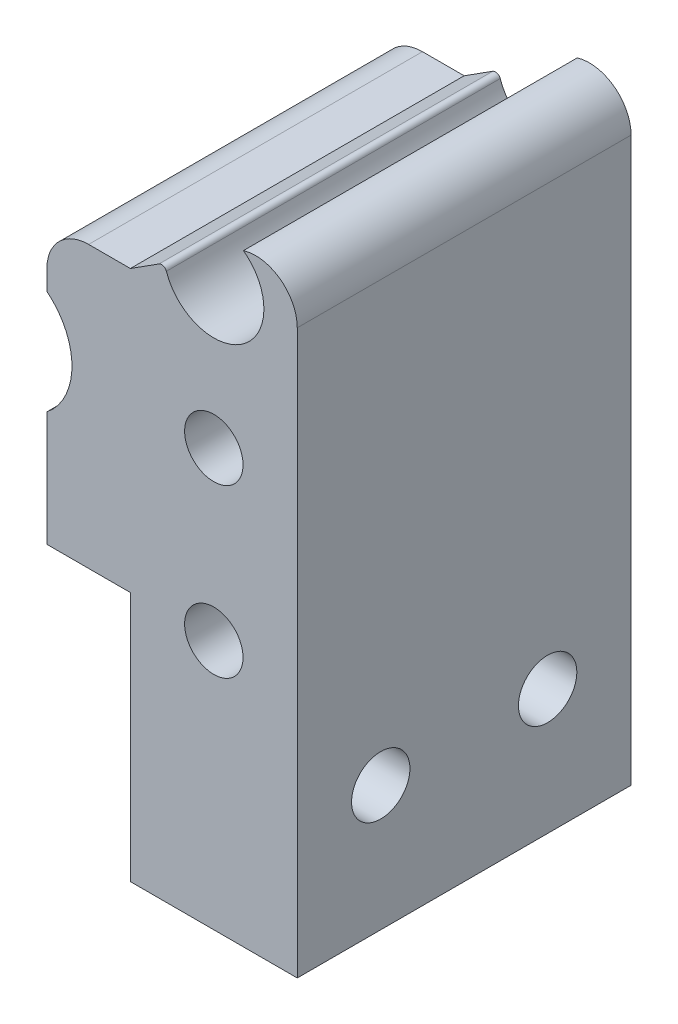
ISO-10303-21;
HEADER;
FILE_DESCRIPTION(('STEP AP214'),'2;1');
FILE_NAME('part.step','',(''),(''),'','','');
FILE_SCHEMA(('AUTOMOTIVE_DESIGN { 1 0 10303 214 1 1 1 1 }'));
ENDSEC;
DATA;
#1=APPLICATION_CONTEXT('core data for automotive mechanical design processes');
#2=APPLICATION_PROTOCOL_DEFINITION('international standard','automotive_design',2000,#1);
#3=PRODUCT_CONTEXT('',#1,'mechanical');
#4=PRODUCT('Part','Part','',(#3));
#5=PRODUCT_RELATED_PRODUCT_CATEGORY('part','',(#4));
#6=PRODUCT_DEFINITION_FORMATION('','',#4);
#7=PRODUCT_DEFINITION_CONTEXT('part definition',#1,'design');
#8=PRODUCT_DEFINITION('design','',#6,#7);
#9=PRODUCT_DEFINITION_SHAPE('','',#8);
#10=(LENGTH_UNIT() NAMED_UNIT(*) SI_UNIT(.MILLI.,.METRE.));
#11=(NAMED_UNIT(*) PLANE_ANGLE_UNIT() SI_UNIT($,.RADIAN.));
#12=(NAMED_UNIT(*) SI_UNIT($,.STERADIAN.) SOLID_ANGLE_UNIT());
#13=UNCERTAINTY_MEASURE_WITH_UNIT(LENGTH_MEASURE(1.E-05),#10,'distance_accuracy_value','');
#14=(GEOMETRIC_REPRESENTATION_CONTEXT(3) GLOBAL_UNCERTAINTY_ASSIGNED_CONTEXT((#13)) GLOBAL_UNIT_ASSIGNED_CONTEXT((#10,
#11,#12)) REPRESENTATION_CONTEXT('',''));
#15=CARTESIAN_POINT('',(0.,0.,0.));
#16=DIRECTION('',(0.,0.,1.));
#17=DIRECTION('',(1.,0.,0.));
#18=AXIS2_PLACEMENT_3D('',#15,#16,#17);
#19=CARTESIAN_POINT('',(-4.99999999999999,0.,20.));
#20=DIRECTION('',(1.,0.,0.));
#21=DIRECTION('',(0.,1.,0.));
#22=AXIS2_PLACEMENT_3D('',#19,#20,#21);
#23=PLANE('',#22);
#24=DIRECTION('',(0.,-1.,0.));
#25=VECTOR('',#24,1.);
#26=CARTESIAN_POINT('',(-4.99999999999999,0.,20.));
#27=LINE('',#26,#25);
#28=CARTESIAN_POINT('',(-5.,29.3146486959626,20.));
#29=VERTEX_POINT('',#28);
#30=CARTESIAN_POINT('',(-5.,28.1224989991992,20.));
#31=VERTEX_POINT('',#30);
#32=EDGE_CURVE('E265',#29,#31,#27,.T.);
#33=ORIENTED_EDGE('',*,*,#32,.F.);
#34=DIRECTION('',(0.,0.,-1.));
#35=VECTOR('',#34,1.);
#36=CARTESIAN_POINT('',(-5.,29.3146486959626,20.));
#37=LINE('',#36,#35);
#38=CARTESIAN_POINT('',(-5.,29.3146486959626,0.));
#39=VERTEX_POINT('',#38);
#40=EDGE_CURVE('E236',#29,#39,#37,.T.);
#41=ORIENTED_EDGE('',*,*,#40,.T.);
#42=DIRECTION('',(0.,-1.,0.));
#43=VECTOR('',#42,1.);
#44=CARTESIAN_POINT('',(-4.99999999999999,0.,0.));
#45=LINE('',#44,#43);
#46=CARTESIAN_POINT('',(-5.,28.1224989991992,0.));
#47=VERTEX_POINT('',#46);
#48=EDGE_CURVE('E176',#39,#47,#45,.T.);
#49=ORIENTED_EDGE('',*,*,#48,.T.);
#50=DIRECTION('',(0.,0.,1.));
#51=VECTOR('',#50,1.);
#52=CARTESIAN_POINT('',(-5.,28.1224989991992,0.));
#53=LINE('',#52,#51);
#54=EDGE_CURVE('E152',#47,#31,#53,.T.);
#55=ORIENTED_EDGE('',*,*,#54,.T.);
#56=EDGE_LOOP('',(#33,#41,#49,#55));
#57=FACE_BOUND('',#56,.T.);
#58=ADVANCED_FACE('F49',(#57),#23,.F.);
#59=CARTESIAN_POINT('',(-14.4169319274931,22.6300501128707,20.));
#60=DIRECTION('',(-0.537299608346822,0.843391445812887,0.));
#61=DIRECTION('',(-0.843391445812887,-0.537299608346822,0.));
#62=AXIS2_PLACEMENT_3D('',#59,#60,#61);
#63=PLANE('',#62);
#64=DIRECTION('',(0.843391445812887,0.537299608346822,0.));
#65=VECTOR('',#64,1.);
#66=CARTESIAN_POINT('',(-14.4169319274931,22.6300501128707,20.));
#67=LINE('',#66,#65);
#68=CARTESIAN_POINT('',(0.,31.8146486959626,20.));
#69=VERTEX_POINT('',#68);
#70=CARTESIAN_POINT('',(1.71274737401555,32.905789112224,20.));
#71=VERTEX_POINT('',#70);
#72=EDGE_CURVE('E206',#69,#71,#67,.T.);
#73=ORIENTED_EDGE('',*,*,#72,.T.);
#74=DIRECTION('',(0.,0.,-1.));
#75=VECTOR('',#74,1.);
#76=CARTESIAN_POINT('',(1.71274737401554,32.905789112224,0.));
#77=LINE('',#76,#75);
#78=CARTESIAN_POINT('',(1.71274737401555,32.905789112224,0.));
#79=VERTEX_POINT('',#78);
#80=EDGE_CURVE('E58',#71,#79,#77,.T.);
#81=ORIENTED_EDGE('',*,*,#80,.T.);
#82=DIRECTION('',(0.843391445812887,0.537299608346822,0.));
#83=VECTOR('',#82,1.);
#84=CARTESIAN_POINT('',(-14.4169319274931,22.6300501128707,0.));
#85=LINE('',#84,#83);
#86=CARTESIAN_POINT('',(0.,31.8146486959626,0.));
#87=VERTEX_POINT('',#86);
#88=EDGE_CURVE('E198',#87,#79,#85,.T.);
#89=ORIENTED_EDGE('',*,*,#88,.F.);
#90=DIRECTION('',(0.,0.,-1.));
#91=VECTOR('',#90,1.);
#92=CARTESIAN_POINT('',(0.,31.8146486959626,20.));
#93=LINE('',#92,#91);
#94=EDGE_CURVE('E202',#69,#87,#93,.T.);
#95=ORIENTED_EDGE('',*,*,#94,.F.);
#96=EDGE_LOOP('',(#73,#81,#89,#95));
#97=FACE_BOUND('',#96,.T.);
#98=ADVANCED_FACE('F362',(#97),#63,.T.);
#99=CARTESIAN_POINT('',(0.,31.8146486959626,20.));
#100=DIRECTION('',(0.,-1.,0.));
#101=DIRECTION('',(0.,0.,-1.));
#102=AXIS2_PLACEMENT_3D('',#99,#100,#101);
#103=PLANE('',#102);
#104=DIRECTION('',(-1.,0.,0.));
#105=VECTOR('',#104,1.);
#106=CARTESIAN_POINT('',(0.,31.8146486959626,0.));
#107=LINE('',#106,#105);
#108=CARTESIAN_POINT('',(-2.5,31.8146486959626,0.));
#109=VERTEX_POINT('',#108);
#110=EDGE_CURVE('E177',#87,#109,#107,.T.);
#111=ORIENTED_EDGE('',*,*,#110,.T.);
#112=DIRECTION('',(0.,0.,-1.));
#113=VECTOR('',#112,1.);
#114=CARTESIAN_POINT('',(-2.5,31.8146486959626,20.));
#115=LINE('',#114,#113);
#116=CARTESIAN_POINT('',(-2.5,31.8146486959626,20.));
#117=VERTEX_POINT('',#116);
#118=EDGE_CURVE('E240',#109,#117,#115,.F.);
#119=ORIENTED_EDGE('',*,*,#118,.T.);
#120=DIRECTION('',(-1.,0.,0.));
#121=VECTOR('',#120,1.);
#122=CARTESIAN_POINT('',(0.,31.8146486959626,20.));
#123=LINE('',#122,#121);
#124=EDGE_CURVE('E201',#69,#117,#123,.T.);
#125=ORIENTED_EDGE('',*,*,#124,.F.);
#126=ORIENTED_EDGE('',*,*,#94,.T.);
#127=EDGE_LOOP('',(#111,#119,#125,#126));
#128=FACE_BOUND('',#127,.T.);
#129=ADVANCED_FACE('F351',(#128),#103,.F.);
#130=CARTESIAN_POINT('',(-5.,21.8775010008008,20.));
#131=VERTEX_POINT('',#130);
#132=CARTESIAN_POINT('',(-5.,15.,20.));
#133=VERTEX_POINT('',#132);
#134=EDGE_CURVE('E166',#131,#133,#27,.T.);
#135=ORIENTED_EDGE('',*,*,#134,.F.);
#136=DIRECTION('',(0.,0.,1.));
#137=VECTOR('',#136,1.);
#138=CARTESIAN_POINT('',(-5.,21.8775010008008,0.));
#139=LINE('',#138,#137);
#140=CARTESIAN_POINT('',(-5.,21.8775010008008,0.));
#141=VERTEX_POINT('',#140);
#142=EDGE_CURVE('E149',#131,#141,#139,.F.);
#143=ORIENTED_EDGE('',*,*,#142,.T.);
#144=CARTESIAN_POINT('',(-5.,15.,0.));
#145=VERTEX_POINT('',#144);
#146=EDGE_CURVE('E164',#141,#145,#45,.T.);
#147=ORIENTED_EDGE('',*,*,#146,.T.);
#148=DIRECTION('',(0.,0.,-1.));
#149=VECTOR('',#148,1.);
#150=CARTESIAN_POINT('',(-5.,15.,20.));
#151=LINE('',#150,#149);
#152=EDGE_CURVE('E158',#133,#145,#151,.T.);
#153=ORIENTED_EDGE('',*,*,#152,.F.);
#154=EDGE_LOOP('',(#135,#143,#147,#153));
#155=FACE_BOUND('',#154,.T.);
#156=ADVANCED_FACE('F162',(#155),#23,.F.);
#157=CARTESIAN_POINT('',(0.,15.,20.));
#158=DIRECTION('',(0.,-1.,0.));
#159=DIRECTION('',(1.,0.,0.));
#160=AXIS2_PLACEMENT_3D('',#157,#158,#159);
#161=PLANE('',#160);
#162=DIRECTION('',(-1.,0.,0.));
#163=VECTOR('',#162,1.);
#164=CARTESIAN_POINT('',(0.,15.,0.));
#165=LINE('',#164,#163);
#166=CARTESIAN_POINT('',(0.,15.,0.));
#167=VERTEX_POINT('',#166);
#168=EDGE_CURVE('E174',#167,#145,#165,.T.);
#169=ORIENTED_EDGE('',*,*,#168,.F.);
#170=DIRECTION('',(0.,0.,-1.));
#171=VECTOR('',#170,1.);
#172=CARTESIAN_POINT('',(0.,15.,20.));
#173=LINE('',#172,#171);
#174=CARTESIAN_POINT('',(0.,15.,20.));
#175=VERTEX_POINT('',#174);
#176=EDGE_CURVE('E213',#175,#167,#173,.T.);
#177=ORIENTED_EDGE('',*,*,#176,.F.);
#178=DIRECTION('',(-1.,0.,0.));
#179=VECTOR('',#178,1.);
#180=CARTESIAN_POINT('',(0.,15.,20.));
#181=LINE('',#180,#179);
#182=EDGE_CURVE('E261',#175,#133,#181,.T.);
#183=ORIENTED_EDGE('',*,*,#182,.T.);
#184=ORIENTED_EDGE('',*,*,#152,.T.);
#185=EDGE_LOOP('',(#169,#177,#183,#184));
#186=FACE_BOUND('',#185,.T.);
#187=ADVANCED_FACE('F343',(#186),#161,.T.);
#188=CARTESIAN_POINT('',(0.,0.,20.));
#189=DIRECTION('',(-1.,0.,0.));
#190=DIRECTION('',(0.,-1.,0.));
#191=AXIS2_PLACEMENT_3D('',#188,#189,#190);
#192=PLANE('',#191);
#193=CARTESIAN_POINT('',(0.,7.5,15.));
#194=DIRECTION('',(-1.,0.,0.));
#195=DIRECTION('',(0.,-1.,0.));
#196=AXIS2_PLACEMENT_3D('',#193,#194,#195);
#197=CIRCLE('',#196,1.75);
#198=CARTESIAN_POINT('',(0.,5.75,15.));
#199=VERTEX_POINT('',#198);
#200=EDGE_CURVE('E182',#199,#199,#197,.T.);
#201=ORIENTED_EDGE('',*,*,#200,.F.);
#202=EDGE_LOOP('',(#201));
#203=FACE_BOUND('',#202,.T.);
#204=CARTESIAN_POINT('',(0.,7.5,5.));
#205=DIRECTION('',(-1.,0.,0.));
#206=DIRECTION('',(0.,-1.,0.));
#207=AXIS2_PLACEMENT_3D('',#204,#205,#206);
#208=CIRCLE('',#207,1.75);
#209=CARTESIAN_POINT('',(0.,5.75,5.));
#210=VERTEX_POINT('',#209);
#211=EDGE_CURVE('E278',#210,#210,#208,.T.);
#212=ORIENTED_EDGE('',*,*,#211,.F.);
#213=EDGE_LOOP('',(#212));
#214=FACE_BOUND('',#213,.T.);
#215=DIRECTION('',(0.,1.,0.));
#216=VECTOR('',#215,1.);
#217=CARTESIAN_POINT('',(0.,0.,0.));
#218=LINE('',#217,#216);
#219=CARTESIAN_POINT('',(0.,0.,0.));
#220=VERTEX_POINT('',#219);
#221=EDGE_CURVE('E188',#220,#167,#218,.T.);
#222=ORIENTED_EDGE('',*,*,#221,.F.);
#223=DIRECTION('',(0.,0.,-1.));
#224=VECTOR('',#223,1.);
#225=CARTESIAN_POINT('',(0.,0.,20.));
#226=LINE('',#225,#224);
#227=CARTESIAN_POINT('',(0.,0.,20.));
#228=VERTEX_POINT('',#227);
#229=EDGE_CURVE('E210',#228,#220,#226,.T.);
#230=ORIENTED_EDGE('',*,*,#229,.F.);
#231=DIRECTION('',(0.,1.,0.));
#232=VECTOR('',#231,1.);
#233=CARTESIAN_POINT('',(0.,0.,20.));
#234=LINE('',#233,#232);
#235=EDGE_CURVE('E257',#228,#175,#234,.T.);
#236=ORIENTED_EDGE('',*,*,#235,.T.);
#237=ORIENTED_EDGE('',*,*,#176,.T.);
#238=EDGE_LOOP('',(#222,#230,#236,#237));
#239=FACE_BOUND('',#238,.T.);
#240=ADVANCED_FACE('F339',(#203,#214,#239),#192,.T.);
#241=CARTESIAN_POINT('',(0.,0.,20.));
#242=DIRECTION('',(0.,-1.,0.));
#243=DIRECTION('',(1.,0.,0.));
#244=AXIS2_PLACEMENT_3D('',#241,#242,#243);
#245=PLANE('',#244);
#246=DIRECTION('',(-1.,0.,0.));
#247=VECTOR('',#246,1.);
#248=CARTESIAN_POINT('',(0.,0.,0.));
#249=LINE('',#248,#247);
#250=CARTESIAN_POINT('',(10.,0.,0.));
#251=VERTEX_POINT('',#250);
#252=EDGE_CURVE('E191',#251,#220,#249,.T.);
#253=ORIENTED_EDGE('',*,*,#252,.F.);
#254=DIRECTION('',(0.,0.,-1.));
#255=VECTOR('',#254,1.);
#256=CARTESIAN_POINT('',(10.,0.,20.));
#257=LINE('',#256,#255);
#258=CARTESIAN_POINT('',(10.,0.,20.));
#259=VERTEX_POINT('',#258);
#260=EDGE_CURVE('E205',#259,#251,#257,.T.);
#261=ORIENTED_EDGE('',*,*,#260,.F.);
#262=DIRECTION('',(-1.,0.,0.));
#263=VECTOR('',#262,1.);
#264=CARTESIAN_POINT('',(0.,0.,20.));
#265=LINE('',#264,#263);
#266=EDGE_CURVE('E253',#259,#228,#265,.T.);
#267=ORIENTED_EDGE('',*,*,#266,.T.);
#268=ORIENTED_EDGE('',*,*,#229,.T.);
#269=EDGE_LOOP('',(#253,#261,#267,#268));
#270=FACE_BOUND('',#269,.T.);
#271=ADVANCED_FACE('F336',(#270),#245,.T.);
#272=CARTESIAN_POINT('',(10.,0.,20.));
#273=DIRECTION('',(1.,0.,0.));
#274=DIRECTION('',(0.,1.,0.));
#275=AXIS2_PLACEMENT_3D('',#272,#273,#274);
#276=PLANE('',#275);
#277=CARTESIAN_POINT('',(10.,7.5,15.));
#278=DIRECTION('',(1.,0.,0.));
#279=DIRECTION('',(0.,0.,-1.));
#280=AXIS2_PLACEMENT_3D('',#277,#278,#279);
#281=CIRCLE('',#280,1.75);
#282=CARTESIAN_POINT('',(10.,7.5,13.25));
#283=VERTEX_POINT('',#282);
#284=EDGE_CURVE('E282',#283,#283,#281,.T.);
#285=ORIENTED_EDGE('',*,*,#284,.F.);
#286=EDGE_LOOP('',(#285));
#287=FACE_BOUND('',#286,.T.);
#288=CARTESIAN_POINT('',(10.,7.5,5.));
#289=DIRECTION('',(1.,0.,0.));
#290=DIRECTION('',(0.,0.,-1.));
#291=AXIS2_PLACEMENT_3D('',#288,#289,#290);
#292=CIRCLE('',#291,1.75);
#293=CARTESIAN_POINT('',(10.,7.5,3.25));
#294=VERTEX_POINT('',#293);
#295=EDGE_CURVE('E283',#294,#294,#292,.T.);
#296=ORIENTED_EDGE('',*,*,#295,.F.);
#297=EDGE_LOOP('',(#296));
#298=FACE_BOUND('',#297,.T.);
#299=DIRECTION('',(0.,-1.,0.));
#300=VECTOR('',#299,1.);
#301=CARTESIAN_POINT('',(10.,0.,0.));
#302=LINE('',#301,#300);
#303=CARTESIAN_POINT('',(9.99999999999999,33.7376848909864,0.));
#304=VERTEX_POINT('',#303);
#305=EDGE_CURVE('E195',#304,#251,#302,.T.);
#306=ORIENTED_EDGE('',*,*,#305,.F.);
#307=DIRECTION('',(0.,0.,-1.));
#308=VECTOR('',#307,1.);
#309=CARTESIAN_POINT('',(9.99999999999999,33.7376848909864,20.));
#310=LINE('',#309,#308);
#311=CARTESIAN_POINT('',(9.99999999999999,33.7376848909864,20.));
#312=VERTEX_POINT('',#311);
#313=EDGE_CURVE('E226',#304,#312,#310,.F.);
#314=ORIENTED_EDGE('',*,*,#313,.T.);
#315=DIRECTION('',(0.,-1.,0.));
#316=VECTOR('',#315,1.);
#317=CARTESIAN_POINT('',(10.,0.,20.));
#318=LINE('',#317,#316);
#319=EDGE_CURVE('E251',#312,#259,#318,.T.);
#320=ORIENTED_EDGE('',*,*,#319,.T.);
#321=ORIENTED_EDGE('',*,*,#260,.T.);
#322=EDGE_LOOP('',(#306,#314,#320,#321));
#323=FACE_BOUND('',#322,.T.);
#324=ADVANCED_FACE('F332',(#287,#298,#323),#276,.T.);
#325=CARTESIAN_POINT('',(0.,0.,20.));
#326=DIRECTION('',(0.,0.,1.));
#327=DIRECTION('',(1.,0.,0.));
#328=AXIS2_PLACEMENT_3D('',#325,#326,#327);
#329=PLANE('',#328);
#330=CARTESIAN_POINT('',(5.,33.71,20.));
#331=DIRECTION('',(0.,0.,1.));
#332=DIRECTION('',(1.,0.,0.));
#333=AXIS2_PLACEMENT_3D('',#330,#331,#332);
#334=CIRCLE('',#333,3.);
#335=CARTESIAN_POINT('',(2.15812477865418,32.7488833440728,20.));
#336=VERTEX_POINT('',#335);
#337=CARTESIAN_POINT('',(6.77335705099843,36.1297530389844,20.));
#338=VERTEX_POINT('',#337);
#339=EDGE_CURVE('E168',#336,#338,#334,.T.);
#340=ORIENTED_EDGE('',*,*,#339,.F.);
#341=CARTESIAN_POINT('',(1.87393725651959,32.6527716784801,20.));
#342=DIRECTION('',(0.,0.,1.));
#343=DIRECTION('',(1.,0.,0.));
#344=AXIS2_PLACEMENT_3D('',#341,#342,#343);
#345=CIRCLE('',#344,0.3);
#346=EDGE_CURVE('E72',#336,#71,#345,.T.);
#347=ORIENTED_EDGE('',*,*,#346,.T.);
#348=ORIENTED_EDGE('',*,*,#72,.F.);
#349=ORIENTED_EDGE('',*,*,#124,.T.);
#350=CARTESIAN_POINT('',(-2.5,29.3146486959626,20.));
#351=DIRECTION('',(0.,0.,1.));
#352=DIRECTION('',(1.,0.,0.));
#353=AXIS2_PLACEMENT_3D('',#350,#351,#352);
#354=CIRCLE('',#353,2.5);
#355=EDGE_CURVE('E229',#117,#29,#354,.T.);
#356=ORIENTED_EDGE('',*,*,#355,.T.);
#357=ORIENTED_EDGE('',*,*,#32,.T.);
#358=CARTESIAN_POINT('',(-7.5,25.,20.));
#359=DIRECTION('',(0.,0.,1.));
#360=DIRECTION('',(1.,0.,0.));
#361=AXIS2_PLACEMENT_3D('',#358,#359,#360);
#362=CIRCLE('',#361,4.);
#363=EDGE_CURVE('E304',#131,#31,#362,.T.);
#364=ORIENTED_EDGE('',*,*,#363,.F.);
#365=ORIENTED_EDGE('',*,*,#134,.T.);
#366=ORIENTED_EDGE('',*,*,#182,.F.);
#367=ORIENTED_EDGE('',*,*,#235,.F.);
#368=ORIENTED_EDGE('',*,*,#266,.F.);
#369=ORIENTED_EDGE('',*,*,#319,.F.);
#370=CARTESIAN_POINT('',(7.49999999999999,33.7376848909864,20.));
#371=DIRECTION('',(0.,0.,1.));
#372=DIRECTION('',(1.,0.,0.));
#373=AXIS2_PLACEMENT_3D('',#370,#371,#372);
#374=CIRCLE('',#373,2.5);
#375=EDGE_CURVE('E232',#312,#338,#374,.T.);
#376=ORIENTED_EDGE('',*,*,#375,.T.);
#377=EDGE_LOOP('',(#340,#347,#348,#349,#356,#357,#364,#365,#366,#367,#368,#369,#376));
#378=FACE_BOUND('',#377,.T.);
#379=CARTESIAN_POINT('',(5.,25.,20.));
#380=DIRECTION('',(0.,0.,1.));
#381=DIRECTION('',(1.,0.,0.));
#382=AXIS2_PLACEMENT_3D('',#379,#380,#381);
#383=CIRCLE('',#382,1.75);
#384=CARTESIAN_POINT('',(6.75,25.,20.));
#385=VERTEX_POINT('',#384);
#386=EDGE_CURVE('E307',#385,#385,#383,.T.);
#387=ORIENTED_EDGE('',*,*,#386,.F.);
#388=EDGE_LOOP('',(#387));
#389=FACE_BOUND('',#388,.T.);
#390=CARTESIAN_POINT('',(5.,15.,20.));
#391=DIRECTION('',(0.,0.,1.));
#392=DIRECTION('',(1.,0.,0.));
#393=AXIS2_PLACEMENT_3D('',#390,#391,#392);
#394=CIRCLE('',#393,1.75);
#395=CARTESIAN_POINT('',(6.75,15.,20.));
#396=VERTEX_POINT('',#395);
#397=EDGE_CURVE('E296',#396,#396,#394,.T.);
#398=ORIENTED_EDGE('',*,*,#397,.F.);
#399=EDGE_LOOP('',(#398));
#400=FACE_BOUND('',#399,.T.);
#401=ADVANCED_FACE('F323',(#378,#389,#400),#329,.T.);
#402=CARTESIAN_POINT('',(0.,0.,0.));
#403=DIRECTION('',(0.,0.,1.));
#404=DIRECTION('',(1.,0.,0.));
#405=AXIS2_PLACEMENT_3D('',#402,#403,#404);
#406=PLANE('',#405);
#407=CARTESIAN_POINT('',(5.,25.,0.));
#408=DIRECTION('',(0.,0.,1.));
#409=DIRECTION('',(1.,0.,0.));
#410=AXIS2_PLACEMENT_3D('',#407,#408,#409);
#411=CIRCLE('',#410,1.75);
#412=CARTESIAN_POINT('',(6.75,25.,0.));
#413=VERTEX_POINT('',#412);
#414=EDGE_CURVE('E311',#413,#413,#411,.T.);
#415=ORIENTED_EDGE('',*,*,#414,.T.);
#416=EDGE_LOOP('',(#415));
#417=FACE_BOUND('',#416,.T.);
#418=CARTESIAN_POINT('',(5.,15.,0.));
#419=DIRECTION('',(0.,0.,1.));
#420=DIRECTION('',(1.,0.,0.));
#421=AXIS2_PLACEMENT_3D('',#418,#419,#420);
#422=CIRCLE('',#421,1.75);
#423=CARTESIAN_POINT('',(6.75,15.,0.));
#424=VERTEX_POINT('',#423);
#425=EDGE_CURVE('E300',#424,#424,#422,.T.);
#426=ORIENTED_EDGE('',*,*,#425,.T.);
#427=EDGE_LOOP('',(#426));
#428=FACE_BOUND('',#427,.T.);
#429=ORIENTED_EDGE('',*,*,#88,.T.);
#430=CARTESIAN_POINT('',(1.87393725651959,32.6527716784801,0.));
#431=DIRECTION('',(0.,0.,1.));
#432=DIRECTION('',(1.,0.,0.));
#433=AXIS2_PLACEMENT_3D('',#430,#431,#432);
#434=CIRCLE('',#433,0.3);
#435=CARTESIAN_POINT('',(2.15812477865418,32.7488833440728,0.));
#436=VERTEX_POINT('',#435);
#437=EDGE_CURVE('E11',#79,#436,#434,.F.);
#438=ORIENTED_EDGE('',*,*,#437,.T.);
#439=CARTESIAN_POINT('',(5.,33.71,0.));
#440=DIRECTION('',(0.,0.,1.));
#441=DIRECTION('',(1.,0.,0.));
#442=AXIS2_PLACEMENT_3D('',#439,#440,#441);
#443=CIRCLE('',#442,3.);
#444=CARTESIAN_POINT('',(6.77335705099843,36.1297530389844,0.));
#445=VERTEX_POINT('',#444);
#446=EDGE_CURVE('E157',#436,#445,#443,.T.);
#447=ORIENTED_EDGE('',*,*,#446,.T.);
#448=CARTESIAN_POINT('',(7.49999999999999,33.7376848909864,0.));
#449=DIRECTION('',(0.,0.,1.));
#450=DIRECTION('',(1.,0.,0.));
#451=AXIS2_PLACEMENT_3D('',#448,#449,#450);
#452=CIRCLE('',#451,2.5);
#453=EDGE_CURVE('E223',#445,#304,#452,.F.);
#454=ORIENTED_EDGE('',*,*,#453,.T.);
#455=ORIENTED_EDGE('',*,*,#305,.T.);
#456=ORIENTED_EDGE('',*,*,#252,.T.);
#457=ORIENTED_EDGE('',*,*,#221,.T.);
#458=ORIENTED_EDGE('',*,*,#168,.T.);
#459=ORIENTED_EDGE('',*,*,#146,.F.);
#460=CARTESIAN_POINT('',(-7.5,25.,0.));
#461=DIRECTION('',(0.,0.,1.));
#462=DIRECTION('',(1.,0.,0.));
#463=AXIS2_PLACEMENT_3D('',#460,#461,#462);
#464=CIRCLE('',#463,4.);
#465=EDGE_CURVE('E145',#141,#47,#464,.T.);
#466=ORIENTED_EDGE('',*,*,#465,.T.);
#467=ORIENTED_EDGE('',*,*,#48,.F.);
#468=CARTESIAN_POINT('',(-2.5,29.3146486959626,0.));
#469=DIRECTION('',(0.,0.,1.));
#470=DIRECTION('',(1.,0.,0.));
#471=AXIS2_PLACEMENT_3D('',#468,#469,#470);
#472=CIRCLE('',#471,2.5);
#473=EDGE_CURVE('E220',#39,#109,#472,.F.);
#474=ORIENTED_EDGE('',*,*,#473,.T.);
#475=ORIENTED_EDGE('',*,*,#110,.F.);
#476=EDGE_LOOP('',(#429,#438,#447,#454,#455,#456,#457,#458,#459,#466,#467,#474,#475));
#477=FACE_BOUND('',#476,.T.);
#478=ADVANCED_FACE('F171',(#417,#428,#477),#406,.F.);
#479=CARTESIAN_POINT('',(-5.,7.5,5.));
#480=DIRECTION('',(1.,0.,0.));
#481=DIRECTION('',(0.,0.,-1.));
#482=AXIS2_PLACEMENT_3D('',#479,#480,#481);
#483=CYLINDRICAL_SURFACE('',#482,1.75);
#484=ORIENTED_EDGE('',*,*,#211,.T.);
#485=EDGE_LOOP('',(#484));
#486=FACE_BOUND('',#485,.T.);
#487=ORIENTED_EDGE('',*,*,#295,.T.);
#488=EDGE_LOOP('',(#487));
#489=FACE_BOUND('',#488,.T.);
#490=ADVANCED_FACE('F425',(#486,#489),#483,.F.);
#491=CARTESIAN_POINT('',(-5.,7.5,15.));
#492=DIRECTION('',(1.,0.,0.));
#493=DIRECTION('',(0.,0.,-1.));
#494=AXIS2_PLACEMENT_3D('',#491,#492,#493);
#495=CYLINDRICAL_SURFACE('',#494,1.75);
#496=ORIENTED_EDGE('',*,*,#200,.T.);
#497=EDGE_LOOP('',(#496));
#498=FACE_BOUND('',#497,.T.);
#499=ORIENTED_EDGE('',*,*,#284,.T.);
#500=EDGE_LOOP('',(#499));
#501=FACE_BOUND('',#500,.T.);
#502=ADVANCED_FACE('F447',(#498,#501),#495,.F.);
#503=CARTESIAN_POINT('',(5.,15.,0.));
#504=DIRECTION('',(0.,0.,1.));
#505=DIRECTION('',(1.,0.,0.));
#506=AXIS2_PLACEMENT_3D('',#503,#504,#505);
#507=CYLINDRICAL_SURFACE('',#506,1.75);
#508=ORIENTED_EDGE('',*,*,#425,.F.);
#509=EDGE_LOOP('',(#508));
#510=FACE_BOUND('',#509,.T.);
#511=ORIENTED_EDGE('',*,*,#397,.T.);
#512=EDGE_LOOP('',(#511));
#513=FACE_BOUND('',#512,.T.);
#514=ADVANCED_FACE('F455',(#510,#513),#507,.F.);
#515=CARTESIAN_POINT('',(-7.5,25.,0.));
#516=DIRECTION('',(0.,0.,1.));
#517=DIRECTION('',(1.,0.,0.));
#518=AXIS2_PLACEMENT_3D('',#515,#516,#517);
#519=CYLINDRICAL_SURFACE('',#518,4.);
#520=ORIENTED_EDGE('',*,*,#465,.F.);
#521=ORIENTED_EDGE('',*,*,#142,.F.);
#522=ORIENTED_EDGE('',*,*,#363,.T.);
#523=ORIENTED_EDGE('',*,*,#54,.F.);
#524=EDGE_LOOP('',(#520,#521,#522,#523));
#525=FACE_BOUND('',#524,.T.);
#526=ADVANCED_FACE('F147',(#525),#519,.F.);
#527=CARTESIAN_POINT('',(5.,25.,0.));
#528=DIRECTION('',(0.,0.,1.));
#529=DIRECTION('',(1.,0.,0.));
#530=AXIS2_PLACEMENT_3D('',#527,#528,#529);
#531=CYLINDRICAL_SURFACE('',#530,1.75);
#532=ORIENTED_EDGE('',*,*,#414,.F.);
#533=EDGE_LOOP('',(#532));
#534=FACE_BOUND('',#533,.T.);
#535=ORIENTED_EDGE('',*,*,#386,.T.);
#536=EDGE_LOOP('',(#535));
#537=FACE_BOUND('',#536,.T.);
#538=ADVANCED_FACE('F420',(#534,#537),#531,.F.);
#539=CARTESIAN_POINT('',(5.,33.71,0.));
#540=DIRECTION('',(0.,0.,1.));
#541=DIRECTION('',(1.,0.,0.));
#542=AXIS2_PLACEMENT_3D('',#539,#540,#541);
#543=CYLINDRICAL_SURFACE('',#542,3.);
#544=ORIENTED_EDGE('',*,*,#446,.F.);
#545=DIRECTION('',(0.,0.,1.));
#546=VECTOR('',#545,1.);
#547=CARTESIAN_POINT('',(2.15812477865418,32.7488833440728,0.));
#548=LINE('',#547,#546);
#549=EDGE_CURVE('E243',#436,#336,#548,.T.);
#550=ORIENTED_EDGE('',*,*,#549,.T.);
#551=ORIENTED_EDGE('',*,*,#339,.T.);
#552=DIRECTION('',(0.,0.,1.));
#553=VECTOR('',#552,1.);
#554=CARTESIAN_POINT('',(6.77335705099843,36.1297530389844,0.));
#555=LINE('',#554,#553);
#556=EDGE_CURVE('E287',#338,#445,#555,.F.);
#557=ORIENTED_EDGE('',*,*,#556,.T.);
#558=EDGE_LOOP('',(#544,#550,#551,#557));
#559=FACE_BOUND('',#558,.T.);
#560=ADVANCED_FACE('F318',(#559),#543,.F.);
#561=CARTESIAN_POINT('',(7.49999999999999,33.7376848909864,0.));
#562=DIRECTION('',(0.,0.,1.));
#563=DIRECTION('',(1.,0.,0.));
#564=AXIS2_PLACEMENT_3D('',#561,#562,#563);
#565=CYLINDRICAL_SURFACE('',#564,2.5);
#566=ORIENTED_EDGE('',*,*,#375,.F.);
#567=ORIENTED_EDGE('',*,*,#313,.F.);
#568=ORIENTED_EDGE('',*,*,#453,.F.);
#569=ORIENTED_EDGE('',*,*,#556,.F.);
#570=EDGE_LOOP('',(#566,#567,#568,#569));
#571=FACE_BOUND('',#570,.T.);
#572=ADVANCED_FACE('F329',(#571),#565,.T.);
#573=CARTESIAN_POINT('',(-2.5,29.3146486959626,20.));
#574=DIRECTION('',(0.,0.,-1.));
#575=DIRECTION('',(-1.,0.,0.));
#576=AXIS2_PLACEMENT_3D('',#573,#574,#575);
#577=CYLINDRICAL_SURFACE('',#576,2.5);
#578=ORIENTED_EDGE('',*,*,#355,.F.);
#579=ORIENTED_EDGE('',*,*,#118,.F.);
#580=ORIENTED_EDGE('',*,*,#473,.F.);
#581=ORIENTED_EDGE('',*,*,#40,.F.);
#582=EDGE_LOOP('',(#578,#579,#580,#581));
#583=FACE_BOUND('',#582,.T.);
#584=ADVANCED_FACE('F352',(#583),#577,.T.);
#585=CARTESIAN_POINT('',(1.87393725651959,32.6527716784801,0.));
#586=DIRECTION('',(0.,0.,1.));
#587=DIRECTION('',(1.,0.,0.));
#588=AXIS2_PLACEMENT_3D('',#585,#586,#587);
#589=CYLINDRICAL_SURFACE('',#588,0.3);
#590=ORIENTED_EDGE('',*,*,#437,.F.);
#591=ORIENTED_EDGE('',*,*,#80,.F.);
#592=ORIENTED_EDGE('',*,*,#346,.F.);
#593=ORIENTED_EDGE('',*,*,#549,.F.);
#594=EDGE_LOOP('',(#590,#591,#592,#593));
#595=FACE_BOUND('',#594,.T.);
#596=ADVANCED_FACE('F51',(#595),#589,.T.);
#597=CLOSED_SHELL('',(#58,#98,#129,#156,#187,#240,#271,#324,#401,#478,#490,#502,#514,#526,#538,
#560,#572,#584,#596));
#598=MANIFOLD_SOLID_BREP('B2',#597);
#599=ADVANCED_BREP_SHAPE_REPRESENTATION('',(#18,#598),#14);
#600=SHAPE_DEFINITION_REPRESENTATION(#9,#599);
ENDSEC;
END-ISO-10303-21;
